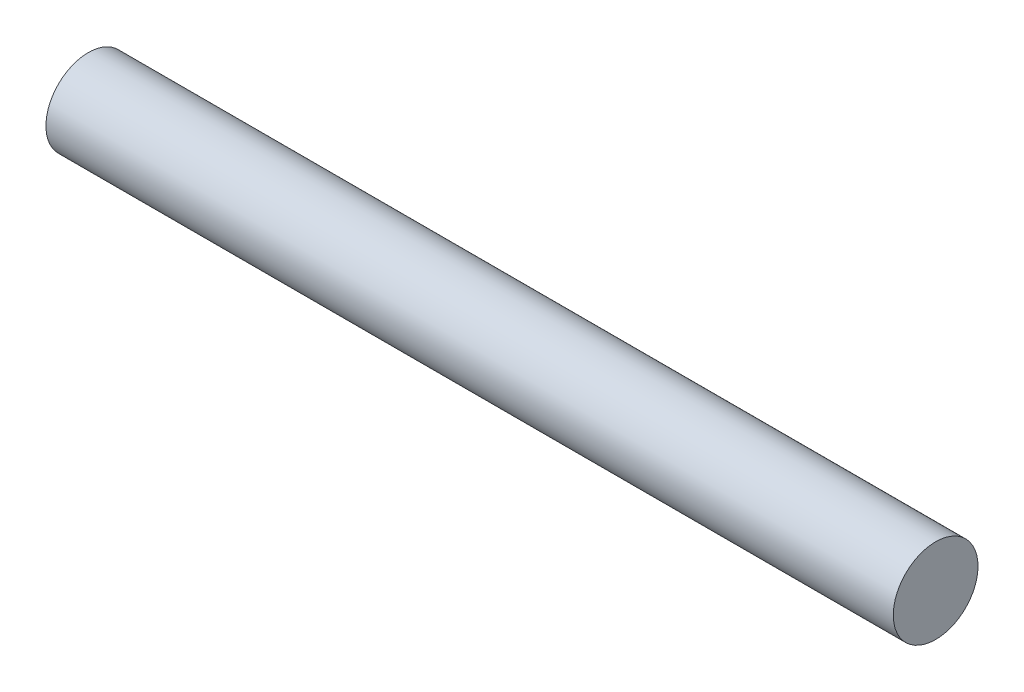
ISO-10303-21;
HEADER;
FILE_DESCRIPTION(('STEP AP214'),'2;1');
FILE_NAME('part.step','',(''),(''),'','','');
FILE_SCHEMA(('AUTOMOTIVE_DESIGN { 1 0 10303 214 1 1 1 1 }'));
ENDSEC;
DATA;
#1=APPLICATION_CONTEXT('core data for automotive mechanical design processes');
#2=APPLICATION_PROTOCOL_DEFINITION('international standard','automotive_design',2000,#1);
#3=PRODUCT_CONTEXT('',#1,'mechanical');
#4=PRODUCT('Part','Part','',(#3));
#5=PRODUCT_RELATED_PRODUCT_CATEGORY('part','',(#4));
#6=PRODUCT_DEFINITION_FORMATION('','',#4);
#7=PRODUCT_DEFINITION_CONTEXT('part definition',#1,'design');
#8=PRODUCT_DEFINITION('design','',#6,#7);
#9=PRODUCT_DEFINITION_SHAPE('','',#8);
#10=(LENGTH_UNIT() NAMED_UNIT(*) SI_UNIT(.MILLI.,.METRE.));
#11=(NAMED_UNIT(*) PLANE_ANGLE_UNIT() SI_UNIT($,.RADIAN.));
#12=(NAMED_UNIT(*) SI_UNIT($,.STERADIAN.) SOLID_ANGLE_UNIT());
#13=UNCERTAINTY_MEASURE_WITH_UNIT(LENGTH_MEASURE(1.E-05),#10,'distance_accuracy_value','');
#14=(GEOMETRIC_REPRESENTATION_CONTEXT(3) GLOBAL_UNCERTAINTY_ASSIGNED_CONTEXT((#13)) GLOBAL_UNIT_ASSIGNED_CONTEXT((#10,
#11,#12)) REPRESENTATION_CONTEXT('',''));
#15=CARTESIAN_POINT('',(0.,0.,0.));
#16=DIRECTION('',(0.,0.,1.));
#17=DIRECTION('',(1.,0.,0.));
#18=AXIS2_PLACEMENT_3D('',#15,#16,#17);
#19=CARTESIAN_POINT('',(304.8,0.,0.));
#20=DIRECTION('',(-1.,0.,0.));
#21=DIRECTION('',(0.,0.,1.));
#22=AXIS2_PLACEMENT_3D('',#19,#20,#21);
#23=CYLINDRICAL_SURFACE('',#22,15.24);
#24=CARTESIAN_POINT('',(304.8,0.,0.));
#25=DIRECTION('',(1.,0.,0.));
#26=DIRECTION('',(0.,0.,-1.));
#27=AXIS2_PLACEMENT_3D('',#24,#25,#26);
#28=CIRCLE('',#27,15.24);
#29=CARTESIAN_POINT('',(304.8,0.,-15.24));
#30=VERTEX_POINT('',#29);
#31=EDGE_CURVE('E10',#30,#30,#28,.T.);
#32=ORIENTED_EDGE('',*,*,#31,.F.);
#33=EDGE_LOOP('',(#32));
#34=FACE_BOUND('',#33,.T.);
#35=CARTESIAN_POINT('',(0.,0.,0.));
#36=DIRECTION('',(1.,0.,0.));
#37=DIRECTION('',(0.,0.,-1.));
#38=AXIS2_PLACEMENT_3D('',#35,#36,#37);
#39=CIRCLE('',#38,15.24);
#40=CARTESIAN_POINT('',(0.,0.,-15.24));
#41=VERTEX_POINT('',#40);
#42=EDGE_CURVE('E35',#41,#41,#39,.T.);
#43=ORIENTED_EDGE('',*,*,#42,.T.);
#44=EDGE_LOOP('',(#43));
#45=FACE_BOUND('',#44,.T.);
#46=ADVANCED_FACE('F32',(#34,#45),#23,.T.);
#47=CARTESIAN_POINT('',(304.8,0.,0.));
#48=DIRECTION('',(1.,0.,0.));
#49=DIRECTION('',(0.,0.,-1.));
#50=AXIS2_PLACEMENT_3D('',#47,#48,#49);
#51=PLANE('',#50);
#52=ORIENTED_EDGE('',*,*,#31,.T.);
#53=EDGE_LOOP('',(#52));
#54=FACE_BOUND('',#53,.T.);
#55=ADVANCED_FACE('F47',(#54),#51,.T.);
#56=CARTESIAN_POINT('',(0.,0.,0.));
#57=DIRECTION('',(1.,0.,0.));
#58=DIRECTION('',(0.,0.,-1.));
#59=AXIS2_PLACEMENT_3D('',#56,#57,#58);
#60=PLANE('',#59);
#61=ORIENTED_EDGE('',*,*,#42,.F.);
#62=EDGE_LOOP('',(#61));
#63=FACE_BOUND('',#62,.T.);
#64=ADVANCED_FACE('F45',(#63),#60,.F.);
#65=CLOSED_SHELL('',(#46,#55,#64));
#66=MANIFOLD_SOLID_BREP('B2',#65);
#67=ADVANCED_BREP_SHAPE_REPRESENTATION('',(#18,#66),#14);
#68=SHAPE_DEFINITION_REPRESENTATION(#9,#67);
ENDSEC;
END-ISO-10303-21;
